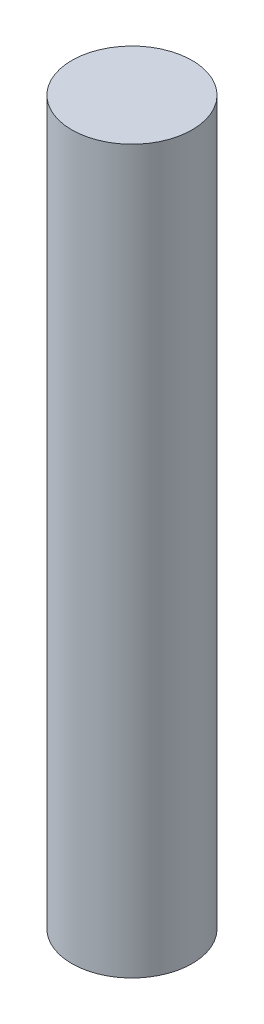
ISO-10303-21;
HEADER;
FILE_DESCRIPTION(('STEP AP214'),'2;1');
FILE_NAME('part.step','',(''),(''),'','','');
FILE_SCHEMA(('AUTOMOTIVE_DESIGN { 1 0 10303 214 1 1 1 1 }'));
ENDSEC;
DATA;
#1=APPLICATION_CONTEXT('core data for automotive mechanical design processes');
#2=APPLICATION_PROTOCOL_DEFINITION('international standard','automotive_design',2000,#1);
#3=PRODUCT_CONTEXT('',#1,'mechanical');
#4=PRODUCT('Part','Part','',(#3));
#5=PRODUCT_RELATED_PRODUCT_CATEGORY('part','',(#4));
#6=PRODUCT_DEFINITION_FORMATION('','',#4);
#7=PRODUCT_DEFINITION_CONTEXT('part definition',#1,'design');
#8=PRODUCT_DEFINITION('design','',#6,#7);
#9=PRODUCT_DEFINITION_SHAPE('','',#8);
#10=(LENGTH_UNIT() NAMED_UNIT(*) SI_UNIT(.MILLI.,.METRE.));
#11=(NAMED_UNIT(*) PLANE_ANGLE_UNIT() SI_UNIT($,.RADIAN.));
#12=(NAMED_UNIT(*) SI_UNIT($,.STERADIAN.) SOLID_ANGLE_UNIT());
#13=UNCERTAINTY_MEASURE_WITH_UNIT(LENGTH_MEASURE(1.E-05),#10,'distance_accuracy_value','');
#14=(GEOMETRIC_REPRESENTATION_CONTEXT(3) GLOBAL_UNCERTAINTY_ASSIGNED_CONTEXT((#13)) GLOBAL_UNIT_ASSIGNED_CONTEXT((#10,
#11,#12)) REPRESENTATION_CONTEXT('',''));
#15=CARTESIAN_POINT('',(0.,0.,0.));
#16=DIRECTION('',(0.,0.,1.));
#17=DIRECTION('',(1.,0.,0.));
#18=AXIS2_PLACEMENT_3D('',#15,#16,#17);
#19=CARTESIAN_POINT('',(0.,150.,0.));
#20=DIRECTION('',(0.,-1.,0.));
#21=DIRECTION('',(0.,0.,-1.));
#22=AXIS2_PLACEMENT_3D('',#19,#20,#21);
#23=CYLINDRICAL_SURFACE('',#22,12.5);
#24=CARTESIAN_POINT('',(0.,150.,0.));
#25=DIRECTION('',(0.,1.,0.));
#26=DIRECTION('',(0.,0.,1.));
#27=AXIS2_PLACEMENT_3D('',#24,#25,#26);
#28=CIRCLE('',#27,12.5);
#29=CARTESIAN_POINT('',(0.,150.,12.5));
#30=VERTEX_POINT('',#29);
#31=EDGE_CURVE('E10',#30,#30,#28,.T.);
#32=ORIENTED_EDGE('',*,*,#31,.F.);
#33=EDGE_LOOP('',(#32));
#34=FACE_BOUND('',#33,.T.);
#35=CARTESIAN_POINT('',(0.,0.,0.));
#36=DIRECTION('',(0.,1.,0.));
#37=DIRECTION('',(0.,0.,1.));
#38=AXIS2_PLACEMENT_3D('',#35,#36,#37);
#39=CIRCLE('',#38,12.5);
#40=CARTESIAN_POINT('',(0.,0.,12.5));
#41=VERTEX_POINT('',#40);
#42=EDGE_CURVE('E36',#41,#41,#39,.T.);
#43=ORIENTED_EDGE('',*,*,#42,.T.);
#44=EDGE_LOOP('',(#43));
#45=FACE_BOUND('',#44,.T.);
#46=ADVANCED_FACE('F33',(#34,#45),#23,.T.);
#47=CARTESIAN_POINT('',(0.,150.,0.));
#48=DIRECTION('',(0.,1.,0.));
#49=DIRECTION('',(0.,0.,1.));
#50=AXIS2_PLACEMENT_3D('',#47,#48,#49);
#51=PLANE('',#50);
#52=ORIENTED_EDGE('',*,*,#31,.T.);
#53=EDGE_LOOP('',(#52));
#54=FACE_BOUND('',#53,.T.);
#55=ADVANCED_FACE('F48',(#54),#51,.T.);
#56=CARTESIAN_POINT('',(0.,0.,0.));
#57=DIRECTION('',(0.,1.,0.));
#58=DIRECTION('',(0.,0.,1.));
#59=AXIS2_PLACEMENT_3D('',#56,#57,#58);
#60=PLANE('',#59);
#61=ORIENTED_EDGE('',*,*,#42,.F.);
#62=EDGE_LOOP('',(#61));
#63=FACE_BOUND('',#62,.T.);
#64=ADVANCED_FACE('F46',(#63),#60,.F.);
#65=CLOSED_SHELL('',(#46,#55,#64));
#66=MANIFOLD_SOLID_BREP('B2',#65);
#67=ADVANCED_BREP_SHAPE_REPRESENTATION('',(#18,#66),#14);
#68=SHAPE_DEFINITION_REPRESENTATION(#9,#67);
ENDSEC;
END-ISO-10303-21;
